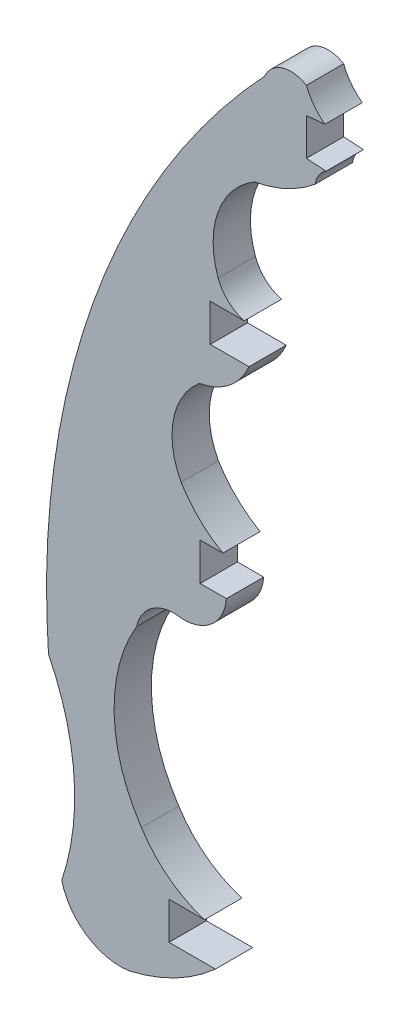
ISO-10303-21;
HEADER;
FILE_DESCRIPTION(('STEP AP214'),'2;1');
FILE_NAME('part.step','',(''),(''),'','','');
FILE_SCHEMA(('AUTOMOTIVE_DESIGN { 1 0 10303 214 1 1 1 1 }'));
ENDSEC;
DATA;
#1=APPLICATION_CONTEXT('core data for automotive mechanical design processes');
#2=APPLICATION_PROTOCOL_DEFINITION('international standard','automotive_design',2000,#1);
#3=PRODUCT_CONTEXT('',#1,'mechanical');
#4=PRODUCT('Part','Part','',(#3));
#5=PRODUCT_RELATED_PRODUCT_CATEGORY('part','',(#4));
#6=PRODUCT_DEFINITION_FORMATION('','',#4);
#7=PRODUCT_DEFINITION_CONTEXT('part definition',#1,'design');
#8=PRODUCT_DEFINITION('design','',#6,#7);
#9=PRODUCT_DEFINITION_SHAPE('','',#8);
#10=(LENGTH_UNIT() NAMED_UNIT(*) SI_UNIT(.MILLI.,.METRE.));
#11=(NAMED_UNIT(*) PLANE_ANGLE_UNIT() SI_UNIT($,.RADIAN.));
#12=(NAMED_UNIT(*) SI_UNIT($,.STERADIAN.) SOLID_ANGLE_UNIT());
#13=UNCERTAINTY_MEASURE_WITH_UNIT(LENGTH_MEASURE(1.E-05),#10,'distance_accuracy_value','');
#14=(GEOMETRIC_REPRESENTATION_CONTEXT(3) GLOBAL_UNCERTAINTY_ASSIGNED_CONTEXT((#13)) GLOBAL_UNIT_ASSIGNED_CONTEXT((#10,
#11,#12)) REPRESENTATION_CONTEXT('',''));
#15=CARTESIAN_POINT('',(0.,0.,0.));
#16=DIRECTION('',(0.,0.,1.));
#17=DIRECTION('',(1.,0.,0.));
#18=AXIS2_PLACEMENT_3D('',#15,#16,#17);
#19=CARTESIAN_POINT('',(-107.580688720072,16.4812326560787,1.524));
#20=DIRECTION('',(0.,0.,-1.));
#21=DIRECTION('',(-1.,0.,0.));
#22=AXIS2_PLACEMENT_3D('',#19,#20,#21);
#23=CYLINDRICAL_SURFACE('',#22,3.12128836578655);
#24=CARTESIAN_POINT('',(-107.580688720072,16.4812326560787,0.));
#25=DIRECTION('',(0.,0.,1.));
#26=DIRECTION('',(1.,0.,0.));
#27=AXIS2_PLACEMENT_3D('',#24,#25,#26);
#28=CIRCLE('',#27,3.12128836578655);
#29=CARTESIAN_POINT('',(-109.57918557092,18.878825490475,0.));
#30=VERTEX_POINT('',#29);
#31=CARTESIAN_POINT('',(-110.328866366672,15.0013810807081,0.));
#32=VERTEX_POINT('',#31);
#33=EDGE_CURVE('E253',#30,#32,#28,.T.);
#34=ORIENTED_EDGE('',*,*,#33,.F.);
#35=DIRECTION('',(0.,0.,-1.));
#36=VECTOR('',#35,1.);
#37=CARTESIAN_POINT('',(-109.57918557092,18.878825490475,1.524));
#38=LINE('',#37,#36);
#39=CARTESIAN_POINT('',(-109.57918557092,18.878825490475,1.524));
#40=VERTEX_POINT('',#39);
#41=EDGE_CURVE('E11',#40,#30,#38,.T.);
#42=ORIENTED_EDGE('',*,*,#41,.F.);
#43=CARTESIAN_POINT('',(-107.580688720072,16.4812326560787,1.524));
#44=DIRECTION('',(0.,0.,1.));
#45=DIRECTION('',(1.,0.,0.));
#46=AXIS2_PLACEMENT_3D('',#43,#44,#45);
#47=CIRCLE('',#46,3.12128836578655);
#48=CARTESIAN_POINT('',(-110.328866366672,15.0013810807081,1.524));
#49=VERTEX_POINT('',#48);
#50=EDGE_CURVE('E332',#40,#49,#47,.T.);
#51=ORIENTED_EDGE('',*,*,#50,.T.);
#52=DIRECTION('',(0.,0.,-1.));
#53=VECTOR('',#52,1.);
#54=CARTESIAN_POINT('',(-110.328866366672,15.0013810807081,1.524));
#55=LINE('',#54,#53);
#56=EDGE_CURVE('E146',#49,#32,#55,.T.);
#57=ORIENTED_EDGE('',*,*,#56,.T.);
#58=EDGE_LOOP('',(#34,#42,#51,#57));
#59=FACE_BOUND('',#58,.T.);
#60=ADVANCED_FACE('F33',(#59),#23,.F.);
#61=CARTESIAN_POINT('',(-110.027978736607,21.5229388257653,1.524));
#62=DIRECTION('',(0.,0.,-1.));
#63=DIRECTION('',(-1.,0.,0.));
#64=AXIS2_PLACEMENT_3D('',#61,#62,#63);
#65=CYLINDRICAL_SURFACE('',#64,2.68193039347167);
#66=CARTESIAN_POINT('',(-110.027978736607,21.5229388257653,0.));
#67=DIRECTION('',(0.,0.,1.));
#68=DIRECTION('',(1.,0.,0.));
#69=AXIS2_PLACEMENT_3D('',#66,#67,#68);
#70=CIRCLE('',#69,2.68193039347167);
#71=CARTESIAN_POINT('',(-107.557691457711,20.4787015945033,0.));
#72=VERTEX_POINT('',#71);
#73=EDGE_CURVE('E256',#72,#30,#70,.F.);
#74=ORIENTED_EDGE('',*,*,#73,.F.);
#75=DIRECTION('',(0.,0.,-1.));
#76=VECTOR('',#75,1.);
#77=CARTESIAN_POINT('',(-107.557691457711,20.4787015945033,1.524));
#78=LINE('',#77,#76);
#79=CARTESIAN_POINT('',(-107.557691457711,20.4787015945033,1.524));
#80=VERTEX_POINT('',#79);
#81=EDGE_CURVE('E41',#80,#72,#78,.T.);
#82=ORIENTED_EDGE('',*,*,#81,.F.);
#83=CARTESIAN_POINT('',(-110.027978736607,21.5229388257653,1.524));
#84=DIRECTION('',(0.,0.,1.));
#85=DIRECTION('',(1.,0.,0.));
#86=AXIS2_PLACEMENT_3D('',#83,#84,#85);
#87=CIRCLE('',#86,2.68193039347167);
#88=EDGE_CURVE('E406',#80,#40,#87,.F.);
#89=ORIENTED_EDGE('',*,*,#88,.T.);
#90=ORIENTED_EDGE('',*,*,#41,.T.);
#91=EDGE_LOOP('',(#74,#82,#89,#90));
#92=FACE_BOUND('',#91,.T.);
#93=ADVANCED_FACE('F394',(#92),#65,.T.);
#94=CARTESIAN_POINT('',(0.,20.4787015945033,1.524));
#95=DIRECTION('',(0.,1.,0.));
#96=DIRECTION('',(0.,0.,1.));
#97=AXIS2_PLACEMENT_3D('',#94,#95,#96);
#98=PLANE('',#97);
#99=DIRECTION('',(1.,0.,0.));
#100=VECTOR('',#99,1.);
#101=CARTESIAN_POINT('',(0.,20.4787015945033,0.));
#102=LINE('',#101,#100);
#103=CARTESIAN_POINT('',(-109.139263732456,20.4787015945033,0.));
#104=VERTEX_POINT('',#103);
#105=EDGE_CURVE('E259',#104,#72,#102,.T.);
#106=ORIENTED_EDGE('',*,*,#105,.F.);
#107=DIRECTION('',(0.,0.,-1.));
#108=VECTOR('',#107,1.);
#109=CARTESIAN_POINT('',(-109.139263732456,20.4787015945033,1.524));
#110=LINE('',#109,#108);
#111=CARTESIAN_POINT('',(-109.139263732456,20.4787015945033,1.524));
#112=VERTEX_POINT('',#111);
#113=EDGE_CURVE('E383',#112,#104,#110,.T.);
#114=ORIENTED_EDGE('',*,*,#113,.F.);
#115=DIRECTION('',(1.,0.,0.));
#116=VECTOR('',#115,1.);
#117=CARTESIAN_POINT('',(0.,20.4787015945033,1.524));
#118=LINE('',#117,#116);
#119=EDGE_CURVE('E390',#112,#80,#118,.T.);
#120=ORIENTED_EDGE('',*,*,#119,.T.);
#121=ORIENTED_EDGE('',*,*,#81,.T.);
#122=EDGE_LOOP('',(#106,#114,#120,#121));
#123=FACE_BOUND('',#122,.T.);
#124=ADVANCED_FACE('F388',(#123),#98,.T.);
#125=CARTESIAN_POINT('',(-109.139263732456,0.,1.524));
#126=DIRECTION('',(1.,0.,0.));
#127=DIRECTION('',(0.,0.,-1.));
#128=AXIS2_PLACEMENT_3D('',#125,#126,#127);
#129=PLANE('',#128);
#130=DIRECTION('',(0.,-1.,0.));
#131=VECTOR('',#130,1.);
#132=CARTESIAN_POINT('',(-109.139263732456,0.,0.));
#133=LINE('',#132,#131);
#134=CARTESIAN_POINT('',(-109.139263732456,22.0063903598248,0.));
#135=VERTEX_POINT('',#134);
#136=EDGE_CURVE('E262',#135,#104,#133,.T.);
#137=ORIENTED_EDGE('',*,*,#136,.F.);
#138=DIRECTION('',(0.,0.,-1.));
#139=VECTOR('',#138,1.);
#140=CARTESIAN_POINT('',(-109.139263732456,22.0063903598248,1.524));
#141=LINE('',#140,#139);
#142=CARTESIAN_POINT('',(-109.139263732456,22.0063903598248,1.524));
#143=VERTEX_POINT('',#142);
#144=EDGE_CURVE('E381',#143,#135,#141,.T.);
#145=ORIENTED_EDGE('',*,*,#144,.F.);
#146=DIRECTION('',(0.,-1.,0.));
#147=VECTOR('',#146,1.);
#148=CARTESIAN_POINT('',(-109.139263732456,0.,1.524));
#149=LINE('',#148,#147);
#150=EDGE_CURVE('E405',#143,#112,#149,.T.);
#151=ORIENTED_EDGE('',*,*,#150,.T.);
#152=ORIENTED_EDGE('',*,*,#113,.T.);
#153=EDGE_LOOP('',(#137,#145,#151,#152));
#154=FACE_BOUND('',#153,.T.);
#155=ADVANCED_FACE('F401',(#154),#129,.T.);
#156=CARTESIAN_POINT('',(0.,22.0063903598248,1.524));
#157=DIRECTION('',(0.,1.,0.));
#158=DIRECTION('',(0.,0.,1.));
#159=AXIS2_PLACEMENT_3D('',#156,#157,#158);
#160=PLANE('',#159);
#161=DIRECTION('',(1.,0.,0.));
#162=VECTOR('',#161,1.);
#163=CARTESIAN_POINT('',(0.,22.0063903598248,0.));
#164=LINE('',#163,#162);
#165=CARTESIAN_POINT('',(-107.752531071807,22.0063903598248,0.));
#166=VERTEX_POINT('',#165);
#167=EDGE_CURVE('E265',#135,#166,#164,.T.);
#168=ORIENTED_EDGE('',*,*,#167,.T.);
#169=DIRECTION('',(0.,0.,-1.));
#170=VECTOR('',#169,1.);
#171=CARTESIAN_POINT('',(-107.752531071807,22.0063903598248,1.524));
#172=LINE('',#171,#170);
#173=CARTESIAN_POINT('',(-107.752531071807,22.0063903598248,1.524));
#174=VERTEX_POINT('',#173);
#175=EDGE_CURVE('E378',#174,#166,#172,.T.);
#176=ORIENTED_EDGE('',*,*,#175,.F.);
#177=DIRECTION('',(1.,0.,0.));
#178=VECTOR('',#177,1.);
#179=CARTESIAN_POINT('',(0.,22.0063903598248,1.524));
#180=LINE('',#179,#178);
#181=EDGE_CURVE('E408',#143,#174,#180,.T.);
#182=ORIENTED_EDGE('',*,*,#181,.F.);
#183=ORIENTED_EDGE('',*,*,#144,.T.);
#184=EDGE_LOOP('',(#168,#176,#182,#183));
#185=FACE_BOUND('',#184,.T.);
#186=ADVANCED_FACE('F490',(#185),#160,.F.);
#187=CARTESIAN_POINT('',(-107.333912624667,23.5262694653189,1.524));
#188=DIRECTION('',(0.,0.,-1.));
#189=DIRECTION('',(-1.,0.,0.));
#190=AXIS2_PLACEMENT_3D('',#187,#188,#189);
#191=CYLINDRICAL_SURFACE('',#190,1.57647515032854);
#192=CARTESIAN_POINT('',(-107.333912624667,23.5262694653189,0.));
#193=DIRECTION('',(0.,0.,1.));
#194=DIRECTION('',(1.,0.,0.));
#195=AXIS2_PLACEMENT_3D('',#192,#193,#194);
#196=CIRCLE('',#195,1.57647515032854);
#197=CARTESIAN_POINT('',(-108.817338403116,22.9926761188112,0.));
#198=VERTEX_POINT('',#197);
#199=EDGE_CURVE('E267',#166,#198,#196,.F.);
#200=ORIENTED_EDGE('',*,*,#199,.T.);
#201=DIRECTION('',(0.,0.,-1.));
#202=VECTOR('',#201,1.);
#203=CARTESIAN_POINT('',(-108.817338403116,22.9926761188112,1.524));
#204=LINE('',#203,#202);
#205=CARTESIAN_POINT('',(-108.817338403116,22.9926761188112,1.524));
#206=VERTEX_POINT('',#205);
#207=EDGE_CURVE('E375',#206,#198,#204,.T.);
#208=ORIENTED_EDGE('',*,*,#207,.F.);
#209=CARTESIAN_POINT('',(-107.333912624667,23.5262694653189,1.524));
#210=DIRECTION('',(0.,0.,1.));
#211=DIRECTION('',(1.,0.,0.));
#212=AXIS2_PLACEMENT_3D('',#209,#210,#211);
#213=CIRCLE('',#212,1.57647515032854);
#214=EDGE_CURVE('E414',#174,#206,#213,.F.);
#215=ORIENTED_EDGE('',*,*,#214,.F.);
#216=ORIENTED_EDGE('',*,*,#175,.T.);
#217=EDGE_LOOP('',(#200,#208,#215,#216));
#218=FACE_BOUND('',#217,.T.);
#219=ADVANCED_FACE('F493',(#218),#191,.F.);
#220=CARTESIAN_POINT('',(-105.565537038083,24.1623602363142,1.524));
#221=DIRECTION('',(0.,0.,-1.));
#222=DIRECTION('',(-1.,0.,0.));
#223=AXIS2_PLACEMENT_3D('',#220,#221,#222);
#224=CYLINDRICAL_SURFACE('',#223,3.45577387170587);
#225=CARTESIAN_POINT('',(-105.565537038083,24.1623602363142,0.));
#226=DIRECTION('',(0.,0.,1.));
#227=DIRECTION('',(1.,0.,0.));
#228=AXIS2_PLACEMENT_3D('',#225,#226,#227);
#229=CIRCLE('',#228,3.45577387170587);
#230=CARTESIAN_POINT('',(-107.333979521729,27.1313641491447,0.));
#231=VERTEX_POINT('',#230);
#232=EDGE_CURVE('E269',#198,#231,#229,.F.);
#233=ORIENTED_EDGE('',*,*,#232,.T.);
#234=DIRECTION('',(0.,0.,-1.));
#235=VECTOR('',#234,1.);
#236=CARTESIAN_POINT('',(-107.333979521729,27.1313641491447,1.524));
#237=LINE('',#236,#235);
#238=CARTESIAN_POINT('',(-107.333979521729,27.1313641491447,1.524));
#239=VERTEX_POINT('',#238);
#240=EDGE_CURVE('E373',#239,#231,#237,.T.);
#241=ORIENTED_EDGE('',*,*,#240,.F.);
#242=CARTESIAN_POINT('',(-105.565537038083,24.1623602363142,1.524));
#243=DIRECTION('',(0.,0.,1.));
#244=DIRECTION('',(1.,0.,0.));
#245=AXIS2_PLACEMENT_3D('',#242,#243,#244);
#246=CIRCLE('',#245,3.45577387170587);
#247=EDGE_CURVE('E416',#206,#239,#246,.F.);
#248=ORIENTED_EDGE('',*,*,#247,.F.);
#249=ORIENTED_EDGE('',*,*,#207,.T.);
#250=EDGE_LOOP('',(#233,#241,#248,#249));
#251=FACE_BOUND('',#250,.T.);
#252=ADVANCED_FACE('F497',(#251),#224,.F.);
#253=CARTESIAN_POINT('',(-108.280674511607,32.3944754546542,1.524));
#254=DIRECTION('',(0.,0.,-1.));
#255=DIRECTION('',(-1.,0.,0.));
#256=AXIS2_PLACEMENT_3D('',#253,#254,#255);
#257=CYLINDRICAL_SURFACE('',#256,5.34757627510278);
#258=CARTESIAN_POINT('',(-108.280674511607,32.3944754546542,0.));
#259=DIRECTION('',(0.,0.,1.));
#260=DIRECTION('',(1.,0.,0.));
#261=AXIS2_PLACEMENT_3D('',#258,#259,#260);
#262=CIRCLE('',#261,5.34757627510278);
#263=CARTESIAN_POINT('',(-104.849681876034,28.2926634705814,0.));
#264=VERTEX_POINT('',#263);
#265=EDGE_CURVE('E272',#264,#231,#262,.F.);
#266=ORIENTED_EDGE('',*,*,#265,.F.);
#267=DIRECTION('',(0.,0.,-1.));
#268=VECTOR('',#267,1.);
#269=CARTESIAN_POINT('',(-104.849681876034,28.2926634705814,1.524));
#270=LINE('',#269,#268);
#271=CARTESIAN_POINT('',(-104.849681876034,28.2926634705814,1.524));
#272=VERTEX_POINT('',#271);
#273=EDGE_CURVE('E371',#272,#264,#270,.T.);
#274=ORIENTED_EDGE('',*,*,#273,.F.);
#275=CARTESIAN_POINT('',(-108.280674511607,32.3944754546542,1.524));
#276=DIRECTION('',(0.,0.,1.));
#277=DIRECTION('',(1.,0.,0.));
#278=AXIS2_PLACEMENT_3D('',#275,#276,#277);
#279=CIRCLE('',#278,5.34757627510278);
#280=EDGE_CURVE('E418',#272,#239,#279,.F.);
#281=ORIENTED_EDGE('',*,*,#280,.T.);
#282=ORIENTED_EDGE('',*,*,#240,.T.);
#283=EDGE_LOOP('',(#266,#274,#281,#282));
#284=FACE_BOUND('',#283,.T.);
#285=ADVANCED_FACE('F501',(#284),#257,.T.);
#286=CARTESIAN_POINT('',(-103.869108877583,28.1418799717256,1.524));
#287=DIRECTION('',(0.,0.,-1.));
#288=DIRECTION('',(-1.,0.,0.));
#289=AXIS2_PLACEMENT_3D('',#286,#287,#288);
#290=CYLINDRICAL_SURFACE('',#289,0.992098316104333);
#291=CARTESIAN_POINT('',(-103.869108877583,28.1418799717256,0.));
#292=DIRECTION('',(0.,0.,1.));
#293=DIRECTION('',(1.,0.,0.));
#294=AXIS2_PLACEMENT_3D('',#291,#292,#293);
#295=CIRCLE('',#294,0.992098316104333);
#296=CARTESIAN_POINT('',(-104.403994807569,28.9774373370335,0.));
#297=VERTEX_POINT('',#296);
#298=EDGE_CURVE('E275',#297,#264,#295,.T.);
#299=ORIENTED_EDGE('',*,*,#298,.F.);
#300=DIRECTION('',(0.,0.,-1.));
#301=VECTOR('',#300,1.);
#302=CARTESIAN_POINT('',(-104.403994807569,28.9774373370335,1.524));
#303=LINE('',#302,#301);
#304=CARTESIAN_POINT('',(-104.403994807569,28.9774373370335,1.524));
#305=VERTEX_POINT('',#304);
#306=EDGE_CURVE('E369',#305,#297,#303,.T.);
#307=ORIENTED_EDGE('',*,*,#306,.F.);
#308=CARTESIAN_POINT('',(-103.869108877583,28.1418799717256,1.524));
#309=DIRECTION('',(0.,0.,1.));
#310=DIRECTION('',(1.,0.,0.));
#311=AXIS2_PLACEMENT_3D('',#308,#309,#310);
#312=CIRCLE('',#311,0.992098316104333);
#313=EDGE_CURVE('E421',#305,#272,#312,.T.);
#314=ORIENTED_EDGE('',*,*,#313,.T.);
#315=ORIENTED_EDGE('',*,*,#273,.T.);
#316=EDGE_LOOP('',(#299,#307,#314,#315));
#317=FACE_BOUND('',#316,.T.);
#318=ADVANCED_FACE('F505',(#317),#290,.F.);
#319=CARTESIAN_POINT('',(1.34778701210068,22.6979872481388,1.524));
#320=DIRECTION('',(0.0592747362554911,0.998241707023826,0.));
#321=DIRECTION('',(-0.998241707023826,0.0592747362554911,0.));
#322=AXIS2_PLACEMENT_3D('',#319,#320,#321);
#323=PLANE('',#322);
#324=DIRECTION('',(0.998241707023826,-0.0592747362554911,0.));
#325=VECTOR('',#324,1.);
#326=CARTESIAN_POINT('',(1.34778701210068,22.6979872481388,0.));
#327=LINE('',#326,#325);
#328=CARTESIAN_POINT('',(-105.211200263327,29.0253685045627,0.));
#329=VERTEX_POINT('',#328);
#330=EDGE_CURVE('E278',#329,#297,#327,.T.);
#331=ORIENTED_EDGE('',*,*,#330,.F.);
#332=DIRECTION('',(0.,0.,-1.));
#333=VECTOR('',#332,1.);
#334=CARTESIAN_POINT('',(-105.211200263327,29.0253685045627,1.524));
#335=LINE('',#334,#333);
#336=CARTESIAN_POINT('',(-105.211200263327,29.0253685045627,1.524));
#337=VERTEX_POINT('',#336);
#338=EDGE_CURVE('E367',#337,#329,#335,.T.);
#339=ORIENTED_EDGE('',*,*,#338,.F.);
#340=DIRECTION('',(0.998241707023826,-0.0592747362554911,0.));
#341=VECTOR('',#340,1.);
#342=CARTESIAN_POINT('',(1.34778701210068,22.6979872481388,1.524));
#343=LINE('',#342,#341);
#344=EDGE_CURVE('E424',#337,#305,#343,.T.);
#345=ORIENTED_EDGE('',*,*,#344,.T.);
#346=ORIENTED_EDGE('',*,*,#306,.T.);
#347=EDGE_LOOP('',(#331,#339,#345,#346));
#348=FACE_BOUND('',#347,.T.);
#349=ADVANCED_FACE('F509',(#348),#323,.T.);
#350=CARTESIAN_POINT('',(-105.211200263327,0.,1.524));
#351=DIRECTION('',(1.,0.,0.));
#352=DIRECTION('',(0.,0.,-1.));
#353=AXIS2_PLACEMENT_3D('',#350,#351,#352);
#354=PLANE('',#353);
#355=DIRECTION('',(0.,-1.,0.));
#356=VECTOR('',#355,1.);
#357=CARTESIAN_POINT('',(-105.211200263327,0.,0.));
#358=LINE('',#357,#356);
#359=CARTESIAN_POINT('',(-105.211200263327,30.5448254073895,0.));
#360=VERTEX_POINT('',#359);
#361=EDGE_CURVE('E281',#360,#329,#358,.T.);
#362=ORIENTED_EDGE('',*,*,#361,.F.);
#363=DIRECTION('',(0.,0.,-1.));
#364=VECTOR('',#363,1.);
#365=CARTESIAN_POINT('',(-105.211200263327,30.5448254073895,1.524));
#366=LINE('',#365,#364);
#367=CARTESIAN_POINT('',(-105.211200263327,30.5448254073895,1.524));
#368=VERTEX_POINT('',#367);
#369=EDGE_CURVE('E365',#368,#360,#366,.T.);
#370=ORIENTED_EDGE('',*,*,#369,.F.);
#371=DIRECTION('',(0.,-1.,0.));
#372=VECTOR('',#371,1.);
#373=CARTESIAN_POINT('',(-105.211200263327,0.,1.524));
#374=LINE('',#373,#372);
#375=EDGE_CURVE('E427',#368,#337,#374,.T.);
#376=ORIENTED_EDGE('',*,*,#375,.T.);
#377=ORIENTED_EDGE('',*,*,#338,.T.);
#378=EDGE_LOOP('',(#362,#370,#376,#377));
#379=FACE_BOUND('',#378,.T.);
#380=ADVANCED_FACE('F513',(#379),#354,.T.);
#381=CARTESIAN_POINT('',(-3.48086621479973,39.5078469395772,1.524));
#382=DIRECTION('',(0.0877657054415344,-0.99614114509358,0.));
#383=DIRECTION('',(0.996141145093581,0.0877657054415344,0.));
#384=AXIS2_PLACEMENT_3D('',#381,#382,#383);
#385=PLANE('',#384);
#386=DIRECTION('',(-0.996141145093581,-0.0877657054415344,0.));
#387=VECTOR('',#386,1.);
#388=CARTESIAN_POINT('',(-3.48086621479973,39.5078469395772,0.));
#389=LINE('',#388,#387);
#390=CARTESIAN_POINT('',(-104.454303839496,30.611512290981,0.));
#391=VERTEX_POINT('',#390);
#392=EDGE_CURVE('E284',#391,#360,#389,.T.);
#393=ORIENTED_EDGE('',*,*,#392,.F.);
#394=DIRECTION('',(0.,0.,-1.));
#395=VECTOR('',#394,1.);
#396=CARTESIAN_POINT('',(-104.454303839496,30.611512290981,1.524));
#397=LINE('',#396,#395);
#398=CARTESIAN_POINT('',(-104.454303839496,30.611512290981,1.524));
#399=VERTEX_POINT('',#398);
#400=EDGE_CURVE('E363',#399,#391,#397,.T.);
#401=ORIENTED_EDGE('',*,*,#400,.F.);
#402=DIRECTION('',(-0.996141145093581,-0.0877657054415344,0.));
#403=VECTOR('',#402,1.);
#404=CARTESIAN_POINT('',(-3.48086621479973,39.5078469395772,1.524));
#405=LINE('',#404,#403);
#406=EDGE_CURVE('E430',#399,#368,#405,.T.);
#407=ORIENTED_EDGE('',*,*,#406,.T.);
#408=ORIENTED_EDGE('',*,*,#369,.T.);
#409=EDGE_LOOP('',(#393,#401,#407,#408));
#410=FACE_BOUND('',#409,.T.);
#411=ADVANCED_FACE('F517',(#410),#385,.T.);
#412=CARTESIAN_POINT('',(-103.059366981798,32.4561400903915,1.524));
#413=DIRECTION('',(0.,0.,-1.));
#414=DIRECTION('',(-1.,0.,0.));
#415=AXIS2_PLACEMENT_3D('',#412,#413,#414);
#416=CYLINDRICAL_SURFACE('',#415,2.31268254529747);
#417=CARTESIAN_POINT('',(-103.059366981798,32.4561400903915,0.));
#418=DIRECTION('',(0.,0.,1.));
#419=DIRECTION('',(1.,0.,0.));
#420=AXIS2_PLACEMENT_3D('',#417,#418,#419);
#421=CIRCLE('',#420,2.31268254529747);
#422=CARTESIAN_POINT('',(-105.211200263327,31.6087239683895,0.));
#423=VERTEX_POINT('',#422);
#424=EDGE_CURVE('E287',#423,#391,#421,.T.);
#425=ORIENTED_EDGE('',*,*,#424,.F.);
#426=DIRECTION('',(0.,0.,-1.));
#427=VECTOR('',#426,1.);
#428=CARTESIAN_POINT('',(-105.211200263327,31.6087239683895,1.524));
#429=LINE('',#428,#427);
#430=CARTESIAN_POINT('',(-105.211200263327,31.6087239683895,1.524));
#431=VERTEX_POINT('',#430);
#432=EDGE_CURVE('E361',#431,#423,#429,.T.);
#433=ORIENTED_EDGE('',*,*,#432,.F.);
#434=CARTESIAN_POINT('',(-103.059366981798,32.4561400903915,1.524));
#435=DIRECTION('',(0.,0.,1.));
#436=DIRECTION('',(1.,0.,0.));
#437=AXIS2_PLACEMENT_3D('',#434,#435,#436);
#438=CIRCLE('',#437,2.31268254529747);
#439=EDGE_CURVE('E433',#431,#399,#438,.T.);
#440=ORIENTED_EDGE('',*,*,#439,.T.);
#441=ORIENTED_EDGE('',*,*,#400,.T.);
#442=EDGE_LOOP('',(#425,#433,#440,#441));
#443=FACE_BOUND('',#442,.T.);
#444=ADVANCED_FACE('F521',(#443),#416,.F.);
#445=CARTESIAN_POINT('',(-105.837320906782,30.611512290981,1.524));
#446=DIRECTION('',(0.,0.,-1.));
#447=DIRECTION('',(-1.,0.,0.));
#448=AXIS2_PLACEMENT_3D('',#445,#446,#447);
#449=CYLINDRICAL_SURFACE('',#448,1.17747959206144);
#450=CARTESIAN_POINT('',(-105.837320906782,30.611512290981,0.));
#451=DIRECTION('',(0.,0.,1.));
#452=DIRECTION('',(1.,0.,0.));
#453=AXIS2_PLACEMENT_3D('',#450,#451,#452);
#454=CIRCLE('',#453,1.17747959206144);
#455=CARTESIAN_POINT('',(-106.916865485232,31.0816630039028,0.));
#456=VERTEX_POINT('',#455);
#457=EDGE_CURVE('E290',#456,#423,#454,.F.);
#458=ORIENTED_EDGE('',*,*,#457,.F.);
#459=DIRECTION('',(0.,0.,-1.));
#460=VECTOR('',#459,1.);
#461=CARTESIAN_POINT('',(-106.916865485232,31.0816630039028,1.524));
#462=LINE('',#461,#460);
#463=CARTESIAN_POINT('',(-106.916865485232,31.0816630039028,1.524));
#464=VERTEX_POINT('',#463);
#465=EDGE_CURVE('E359',#464,#456,#462,.T.);
#466=ORIENTED_EDGE('',*,*,#465,.F.);
#467=CARTESIAN_POINT('',(-105.837320906782,30.611512290981,1.524));
#468=DIRECTION('',(0.,0.,1.));
#469=DIRECTION('',(1.,0.,0.));
#470=AXIS2_PLACEMENT_3D('',#467,#468,#469);
#471=CIRCLE('',#470,1.17747959206144);
#472=EDGE_CURVE('E436',#464,#431,#471,.F.);
#473=ORIENTED_EDGE('',*,*,#472,.T.);
#474=ORIENTED_EDGE('',*,*,#432,.T.);
#475=EDGE_LOOP('',(#458,#466,#473,#474));
#476=FACE_BOUND('',#475,.T.);
#477=ADVANCED_FACE('F525',(#476),#449,.T.);
#478=CARTESIAN_POINT('',(-82.7656833760453,8.50088602335713,1.524));
#479=DIRECTION('',(0.,0.,-1.));
#480=DIRECTION('',(-1.,0.,0.));
#481=AXIS2_PLACEMENT_3D('',#478,#479,#480);
#482=CYLINDRICAL_SURFACE('',#481,33.0631378776461);
#483=CARTESIAN_POINT('',(-82.7656833760453,8.50088602335713,0.));
#484=DIRECTION('',(0.,0.,1.));
#485=DIRECTION('',(1.,0.,0.));
#486=AXIS2_PLACEMENT_3D('',#483,#484,#485);
#487=CIRCLE('',#486,33.0631378776461);
#488=CARTESIAN_POINT('',(-115.749307819385,6.20924798541367,0.));
#489=VERTEX_POINT('',#488);
#490=EDGE_CURVE('E293',#489,#456,#487,.F.);
#491=ORIENTED_EDGE('',*,*,#490,.F.);
#492=DIRECTION('',(0.,0.,-1.));
#493=VECTOR('',#492,1.);
#494=CARTESIAN_POINT('',(-115.749307819385,6.20924798541367,1.524));
#495=LINE('',#494,#493);
#496=CARTESIAN_POINT('',(-115.749307819385,6.20924798541367,1.524));
#497=VERTEX_POINT('',#496);
#498=EDGE_CURVE('E357',#497,#489,#495,.T.);
#499=ORIENTED_EDGE('',*,*,#498,.F.);
#500=CARTESIAN_POINT('',(-82.7656833760453,8.50088602335713,1.524));
#501=DIRECTION('',(0.,0.,1.));
#502=DIRECTION('',(1.,0.,0.));
#503=AXIS2_PLACEMENT_3D('',#500,#501,#502);
#504=CIRCLE('',#503,33.0631378776461);
#505=EDGE_CURVE('E439',#497,#464,#504,.F.);
#506=ORIENTED_EDGE('',*,*,#505,.T.);
#507=ORIENTED_EDGE('',*,*,#465,.T.);
#508=EDGE_LOOP('',(#491,#499,#506,#507));
#509=FACE_BOUND('',#508,.T.);
#510=ADVANCED_FACE('F529',(#509),#482,.T.);
#511=CARTESIAN_POINT('',(-124.730508792739,1.69476314171867,1.524));
#512=DIRECTION('',(0.,0.,-1.));
#513=DIRECTION('',(-1.,0.,0.));
#514=AXIS2_PLACEMENT_3D('',#511,#512,#513);
#515=CYLINDRICAL_SURFACE('',#514,10.0519920576827);
#516=CARTESIAN_POINT('',(-124.730508792739,1.69476314171867,0.));
#517=DIRECTION('',(0.,0.,1.));
#518=DIRECTION('',(1.,0.,0.));
#519=AXIS2_PLACEMENT_3D('',#516,#517,#518);
#520=CIRCLE('',#519,10.0519920576827);
#521=CARTESIAN_POINT('',(-115.20779341501,-1.524,0.));
#522=VERTEX_POINT('',#521);
#523=EDGE_CURVE('E296',#522,#489,#520,.T.);
#524=ORIENTED_EDGE('',*,*,#523,.F.);
#525=DIRECTION('',(0.,0.,-1.));
#526=VECTOR('',#525,1.);
#527=CARTESIAN_POINT('',(-115.20779341501,-1.524,1.524));
#528=LINE('',#527,#526);
#529=CARTESIAN_POINT('',(-115.20779341501,-1.524,1.524));
#530=VERTEX_POINT('',#529);
#531=EDGE_CURVE('E355',#530,#522,#528,.T.);
#532=ORIENTED_EDGE('',*,*,#531,.F.);
#533=CARTESIAN_POINT('',(-124.730508792739,1.69476314171867,1.524));
#534=DIRECTION('',(0.,0.,1.));
#535=DIRECTION('',(1.,0.,0.));
#536=AXIS2_PLACEMENT_3D('',#533,#534,#535);
#537=CIRCLE('',#536,10.0519920576827);
#538=EDGE_CURVE('E442',#530,#497,#537,.T.);
#539=ORIENTED_EDGE('',*,*,#538,.T.);
#540=ORIENTED_EDGE('',*,*,#498,.T.);
#541=EDGE_LOOP('',(#524,#532,#539,#540));
#542=FACE_BOUND('',#541,.T.);
#543=ADVANCED_FACE('F533',(#542),#515,.F.);
#544=CARTESIAN_POINT('',(-112.821376912459,-0.911900097014079,1.524));
#545=DIRECTION('',(0.,0.,-1.));
#546=DIRECTION('',(-1.,0.,0.));
#547=AXIS2_PLACEMENT_3D('',#544,#545,#546);
#548=CYLINDRICAL_SURFACE('',#547,2.46366597063845);
#549=CARTESIAN_POINT('',(-112.821376912459,-0.911900097014079,0.));
#550=DIRECTION('',(0.,0.,1.));
#551=DIRECTION('',(1.,0.,0.));
#552=AXIS2_PLACEMENT_3D('',#549,#550,#551);
#553=CIRCLE('',#552,2.46366597063845);
#554=CARTESIAN_POINT('',(-112.442883949143,-3.34631852686584,0.));
#555=VERTEX_POINT('',#554);
#556=EDGE_CURVE('E299',#555,#522,#553,.F.);
#557=ORIENTED_EDGE('',*,*,#556,.F.);
#558=DIRECTION('',(0.,0.,-1.));
#559=VECTOR('',#558,1.);
#560=CARTESIAN_POINT('',(-112.442883949143,-3.34631852686584,1.524));
#561=LINE('',#560,#559);
#562=CARTESIAN_POINT('',(-112.442883949143,-3.34631852686584,1.524));
#563=VERTEX_POINT('',#562);
#564=EDGE_CURVE('E353',#563,#555,#561,.T.);
#565=ORIENTED_EDGE('',*,*,#564,.F.);
#566=CARTESIAN_POINT('',(-112.821376912459,-0.911900097014079,1.524));
#567=DIRECTION('',(0.,0.,1.));
#568=DIRECTION('',(1.,0.,0.));
#569=AXIS2_PLACEMENT_3D('',#566,#567,#568);
#570=CIRCLE('',#569,2.46366597063845);
#571=EDGE_CURVE('E445',#563,#530,#570,.F.);
#572=ORIENTED_EDGE('',*,*,#571,.T.);
#573=ORIENTED_EDGE('',*,*,#531,.T.);
#574=EDGE_LOOP('',(#557,#565,#572,#573));
#575=FACE_BOUND('',#574,.T.);
#576=ADVANCED_FACE('F537',(#575),#548,.T.);
#577=CARTESIAN_POINT('',(-114.18936905214,4.32394775964582,1.524));
#578=DIRECTION('',(0.,0.,-1.));
#579=DIRECTION('',(-1.,0.,0.));
#580=AXIS2_PLACEMENT_3D('',#577,#578,#579);
#581=CYLINDRICAL_SURFACE('',#580,7.86658726011411);
#582=CARTESIAN_POINT('',(-114.18936905214,4.32394775964582,0.));
#583=DIRECTION('',(0.,0.,1.));
#584=DIRECTION('',(1.,0.,0.));
#585=AXIS2_PLACEMENT_3D('',#582,#583,#584);
#586=CIRCLE('',#585,7.86658726011411);
#587=CARTESIAN_POINT('',(-108.927743626339,-1.524,0.));
#588=VERTEX_POINT('',#587);
#589=EDGE_CURVE('E302',#588,#555,#586,.F.);
#590=ORIENTED_EDGE('',*,*,#589,.F.);
#591=DIRECTION('',(0.,0.,-1.));
#592=VECTOR('',#591,1.);
#593=CARTESIAN_POINT('',(-108.927743626339,-1.524,1.524));
#594=LINE('',#593,#592);
#595=CARTESIAN_POINT('',(-108.927743626339,-1.524,1.524));
#596=VERTEX_POINT('',#595);
#597=EDGE_CURVE('E351',#596,#588,#594,.T.);
#598=ORIENTED_EDGE('',*,*,#597,.F.);
#599=CARTESIAN_POINT('',(-114.18936905214,4.32394775964582,1.524));
#600=DIRECTION('',(0.,0.,1.));
#601=DIRECTION('',(1.,0.,0.));
#602=AXIS2_PLACEMENT_3D('',#599,#600,#601);
#603=CIRCLE('',#602,7.86658726011411);
#604=EDGE_CURVE('E448',#596,#563,#603,.F.);
#605=ORIENTED_EDGE('',*,*,#604,.T.);
#606=ORIENTED_EDGE('',*,*,#564,.T.);
#607=EDGE_LOOP('',(#590,#598,#605,#606));
#608=FACE_BOUND('',#607,.T.);
#609=ADVANCED_FACE('F541',(#608),#581,.T.);
#610=CARTESIAN_POINT('',(0.,-1.524,1.524));
#611=DIRECTION('',(0.,1.,0.));
#612=DIRECTION('',(0.,0.,1.));
#613=AXIS2_PLACEMENT_3D('',#610,#611,#612);
#614=PLANE('',#613);
#615=DIRECTION('',(1.,0.,0.));
#616=VECTOR('',#615,1.);
#617=CARTESIAN_POINT('',(0.,-1.524,0.));
#618=LINE('',#617,#616);
#619=CARTESIAN_POINT('',(-110.824360774291,-1.524,0.));
#620=VERTEX_POINT('',#619);
#621=EDGE_CURVE('E305',#620,#588,#618,.T.);
#622=ORIENTED_EDGE('',*,*,#621,.F.);
#623=DIRECTION('',(0.,0.,-1.));
#624=VECTOR('',#623,1.);
#625=CARTESIAN_POINT('',(-110.824360774291,-1.524,1.524));
#626=LINE('',#625,#624);
#627=CARTESIAN_POINT('',(-110.824360774291,-1.524,1.524));
#628=VERTEX_POINT('',#627);
#629=EDGE_CURVE('E349',#628,#620,#626,.T.);
#630=ORIENTED_EDGE('',*,*,#629,.F.);
#631=DIRECTION('',(1.,0.,0.));
#632=VECTOR('',#631,1.);
#633=CARTESIAN_POINT('',(0.,-1.524,1.524));
#634=LINE('',#633,#632);
#635=EDGE_CURVE('E451',#628,#596,#634,.T.);
#636=ORIENTED_EDGE('',*,*,#635,.T.);
#637=ORIENTED_EDGE('',*,*,#597,.T.);
#638=EDGE_LOOP('',(#622,#630,#636,#637));
#639=FACE_BOUND('',#638,.T.);
#640=ADVANCED_FACE('F545',(#639),#614,.T.);
#641=CARTESIAN_POINT('',(-110.824360774291,0.,1.524));
#642=DIRECTION('',(1.,0.,0.));
#643=DIRECTION('',(0.,0.,-1.));
#644=AXIS2_PLACEMENT_3D('',#641,#642,#643);
#645=PLANE('',#644);
#646=DIRECTION('',(0.,-1.,0.));
#647=VECTOR('',#646,1.);
#648=CARTESIAN_POINT('',(-110.824360774291,0.,0.));
#649=LINE('',#648,#647);
#650=CARTESIAN_POINT('',(-110.824360774291,0.,0.));
#651=VERTEX_POINT('',#650);
#652=EDGE_CURVE('E308',#651,#620,#649,.T.);
#653=ORIENTED_EDGE('',*,*,#652,.F.);
#654=DIRECTION('',(0.,0.,-1.));
#655=VECTOR('',#654,1.);
#656=CARTESIAN_POINT('',(-110.824360774291,0.,1.524));
#657=LINE('',#656,#655);
#658=CARTESIAN_POINT('',(-110.824360774291,0.,1.524));
#659=VERTEX_POINT('',#658);
#660=EDGE_CURVE('E347',#659,#651,#657,.T.);
#661=ORIENTED_EDGE('',*,*,#660,.F.);
#662=DIRECTION('',(0.,-1.,0.));
#663=VECTOR('',#662,1.);
#664=CARTESIAN_POINT('',(-110.824360774291,0.,1.524));
#665=LINE('',#664,#663);
#666=EDGE_CURVE('E454',#659,#628,#665,.T.);
#667=ORIENTED_EDGE('',*,*,#666,.T.);
#668=ORIENTED_EDGE('',*,*,#629,.T.);
#669=EDGE_LOOP('',(#653,#661,#667,#668));
#670=FACE_BOUND('',#669,.T.);
#671=ADVANCED_FACE('F549',(#670),#645,.T.);
#672=CARTESIAN_POINT('',(0.,-1.1494748147781E-13,1.524));
#673=DIRECTION('',(0.,1.,0.));
#674=DIRECTION('',(-1.,0.,0.));
#675=AXIS2_PLACEMENT_3D('',#672,#673,#674);
#676=PLANE('',#675);
#677=DIRECTION('',(1.,0.,0.));
#678=VECTOR('',#677,1.);
#679=CARTESIAN_POINT('',(0.,-1.1494748147781E-13,0.));
#680=LINE('',#679,#678);
#681=CARTESIAN_POINT('',(-109.373389254102,0.,0.));
#682=VERTEX_POINT('',#681);
#683=EDGE_CURVE('E311',#651,#682,#680,.T.);
#684=ORIENTED_EDGE('',*,*,#683,.T.);
#685=DIRECTION('',(0.,0.,-1.));
#686=VECTOR('',#685,1.);
#687=CARTESIAN_POINT('',(-109.373389254102,0.,1.524));
#688=LINE('',#687,#686);
#689=CARTESIAN_POINT('',(-109.373389254102,0.,1.524));
#690=VERTEX_POINT('',#689);
#691=EDGE_CURVE('E344',#690,#682,#688,.T.);
#692=ORIENTED_EDGE('',*,*,#691,.F.);
#693=DIRECTION('',(1.,0.,0.));
#694=VECTOR('',#693,1.);
#695=CARTESIAN_POINT('',(0.,-1.1494748147781E-13,1.524));
#696=LINE('',#695,#694);
#697=EDGE_CURVE('E457',#659,#690,#696,.T.);
#698=ORIENTED_EDGE('',*,*,#697,.F.);
#699=ORIENTED_EDGE('',*,*,#660,.T.);
#700=EDGE_LOOP('',(#684,#692,#698,#699));
#701=FACE_BOUND('',#700,.T.);
#702=ADVANCED_FACE('F553',(#701),#676,.F.);
#703=CARTESIAN_POINT('',(-107.97967598118,4.48553225992145,1.524));
#704=DIRECTION('',(0.,0.,-1.));
#705=DIRECTION('',(-1.,0.,0.));
#706=AXIS2_PLACEMENT_3D('',#703,#704,#705);
#707=CYLINDRICAL_SURFACE('',#706,4.69706678065338);
#708=CARTESIAN_POINT('',(-107.97967598118,4.48553225992145,0.));
#709=DIRECTION('',(0.,0.,1.));
#710=DIRECTION('',(1.,0.,0.));
#711=AXIS2_PLACEMENT_3D('',#708,#709,#710);
#712=CIRCLE('',#711,4.69706678065338);
#713=CARTESIAN_POINT('',(-111.950245847538,1.97614761856357,0.));
#714=VERTEX_POINT('',#713);
#715=EDGE_CURVE('E313',#682,#714,#712,.F.);
#716=ORIENTED_EDGE('',*,*,#715,.T.);
#717=DIRECTION('',(0.,0.,-1.));
#718=VECTOR('',#717,1.);
#719=CARTESIAN_POINT('',(-111.950245847538,1.97614761856357,1.524));
#720=LINE('',#719,#718);
#721=CARTESIAN_POINT('',(-111.950245847538,1.97614761856357,1.524));
#722=VERTEX_POINT('',#721);
#723=EDGE_CURVE('E342',#722,#714,#720,.T.);
#724=ORIENTED_EDGE('',*,*,#723,.F.);
#725=CARTESIAN_POINT('',(-107.97967598118,4.48553225992145,1.524));
#726=DIRECTION('',(0.,0.,1.));
#727=DIRECTION('',(1.,0.,0.));
#728=AXIS2_PLACEMENT_3D('',#725,#726,#727);
#729=CIRCLE('',#728,4.69706678065338);
#730=EDGE_CURVE('E459',#690,#722,#729,.F.);
#731=ORIENTED_EDGE('',*,*,#730,.F.);
#732=ORIENTED_EDGE('',*,*,#691,.T.);
#733=EDGE_LOOP('',(#716,#724,#731,#732));
#734=FACE_BOUND('',#733,.T.);
#735=ADVANCED_FACE('F557',(#734),#707,.F.);
#736=CARTESIAN_POINT('',(-106.520013862702,5.63759579505181,1.524));
#737=DIRECTION('',(0.,0.,-1.));
#738=DIRECTION('',(-1.,0.,0.));
#739=AXIS2_PLACEMENT_3D('',#736,#737,#738);
#740=CYLINDRICAL_SURFACE('',#739,6.54932226709318);
#741=CARTESIAN_POINT('',(-106.520013862702,5.63759579505181,0.));
#742=DIRECTION('',(0.,0.,1.));
#743=DIRECTION('',(1.,0.,0.));
#744=AXIS2_PLACEMENT_3D('',#741,#742,#743);
#745=CIRCLE('',#744,6.54932226709318);
#746=CARTESIAN_POINT('',(-112.143869500187,8.99406267660652,0.));
#747=VERTEX_POINT('',#746);
#748=EDGE_CURVE('E316',#747,#714,#745,.T.);
#749=ORIENTED_EDGE('',*,*,#748,.F.);
#750=DIRECTION('',(0.,0.,-1.));
#751=VECTOR('',#750,1.);
#752=CARTESIAN_POINT('',(-112.143869500187,8.99406267660652,1.524));
#753=LINE('',#752,#751);
#754=CARTESIAN_POINT('',(-112.143869500187,8.99406267660652,1.524));
#755=VERTEX_POINT('',#754);
#756=EDGE_CURVE('E340',#755,#747,#753,.T.);
#757=ORIENTED_EDGE('',*,*,#756,.F.);
#758=CARTESIAN_POINT('',(-106.520013862702,5.63759579505181,1.524));
#759=DIRECTION('',(0.,0.,1.));
#760=DIRECTION('',(1.,0.,0.));
#761=AXIS2_PLACEMENT_3D('',#758,#759,#760);
#762=CIRCLE('',#761,6.54932226709318);
#763=EDGE_CURVE('E461',#755,#722,#762,.T.);
#764=ORIENTED_EDGE('',*,*,#763,.T.);
#765=ORIENTED_EDGE('',*,*,#723,.T.);
#766=EDGE_LOOP('',(#749,#757,#764,#765));
#767=FACE_BOUND('',#766,.T.);
#768=ADVANCED_FACE('F561',(#767),#740,.F.);
#769=CARTESIAN_POINT('',(-110.632863237933,8.68429736091204,1.524));
#770=DIRECTION('',(0.,0.,-1.));
#771=DIRECTION('',(-1.,0.,0.));
#772=AXIS2_PLACEMENT_3D('',#769,#770,#771);
#773=CYLINDRICAL_SURFACE('',#772,1.54243135191798);
#774=CARTESIAN_POINT('',(-110.632863237933,8.68429736091204,0.));
#775=DIRECTION('',(0.,0.,1.));
#776=DIRECTION('',(1.,0.,0.));
#777=AXIS2_PLACEMENT_3D('',#774,#775,#776);
#778=CIRCLE('',#777,1.54243135191798);
#779=CARTESIAN_POINT('',(-110.328866366672,10.1964747240686,0.));
#780=VERTEX_POINT('',#779);
#781=EDGE_CURVE('E319',#780,#747,#778,.T.);
#782=ORIENTED_EDGE('',*,*,#781,.F.);
#783=DIRECTION('',(0.,0.,-1.));
#784=VECTOR('',#783,1.);
#785=CARTESIAN_POINT('',(-110.328866366672,10.1964747240686,1.524));
#786=LINE('',#785,#784);
#787=CARTESIAN_POINT('',(-110.328866366672,10.1964747240686,1.524));
#788=VERTEX_POINT('',#787);
#789=EDGE_CURVE('E338',#788,#780,#786,.T.);
#790=ORIENTED_EDGE('',*,*,#789,.F.);
#791=CARTESIAN_POINT('',(-110.632863237933,8.68429736091204,1.524));
#792=DIRECTION('',(0.,0.,1.));
#793=DIRECTION('',(1.,0.,0.));
#794=AXIS2_PLACEMENT_3D('',#791,#792,#793);
#795=CIRCLE('',#794,1.54243135191798);
#796=EDGE_CURVE('E464',#788,#755,#795,.T.);
#797=ORIENTED_EDGE('',*,*,#796,.T.);
#798=ORIENTED_EDGE('',*,*,#756,.T.);
#799=EDGE_LOOP('',(#782,#790,#797,#798));
#800=FACE_BOUND('',#799,.T.);
#801=ADVANCED_FACE('F565',(#800),#773,.F.);
#802=CARTESIAN_POINT('',(-110.220038630349,11.9391151050452,1.524));
#803=DIRECTION('',(0.,0.,-1.));
#804=DIRECTION('',(-1.,0.,0.));
#805=AXIS2_PLACEMENT_3D('',#802,#803,#804);
#806=CYLINDRICAL_SURFACE('',#805,1.74603521545344);
#807=CARTESIAN_POINT('',(-110.220038630349,11.9391151050452,0.));
#808=DIRECTION('',(0.,0.,1.));
#809=DIRECTION('',(1.,0.,0.));
#810=AXIS2_PLACEMENT_3D('',#807,#808,#809);
#811=CIRCLE('',#810,1.74603521545344);
#812=CARTESIAN_POINT('',(-108.478697007342,11.8111763478623,0.));
#813=VERTEX_POINT('',#812);
#814=EDGE_CURVE('E322',#813,#780,#811,.F.);
#815=ORIENTED_EDGE('',*,*,#814,.F.);
#816=DIRECTION('',(0.,0.,-1.));
#817=VECTOR('',#816,1.);
#818=CARTESIAN_POINT('',(-108.478697007342,11.8111763478623,1.524));
#819=LINE('',#818,#817);
#820=CARTESIAN_POINT('',(-108.478697007342,11.8111763478623,1.524));
#821=VERTEX_POINT('',#820);
#822=EDGE_CURVE('E336',#821,#813,#819,.T.);
#823=ORIENTED_EDGE('',*,*,#822,.F.);
#824=CARTESIAN_POINT('',(-110.220038630349,11.9391151050452,1.524));
#825=DIRECTION('',(0.,0.,1.));
#826=DIRECTION('',(1.,0.,0.));
#827=AXIS2_PLACEMENT_3D('',#824,#825,#826);
#828=CIRCLE('',#827,1.74603521545344);
#829=EDGE_CURVE('E248',#821,#788,#828,.F.);
#830=ORIENTED_EDGE('',*,*,#829,.T.);
#831=ORIENTED_EDGE('',*,*,#789,.T.);
#832=EDGE_LOOP('',(#815,#823,#830,#831));
#833=FACE_BOUND('',#832,.T.);
#834=ADVANCED_FACE('F469',(#833),#806,.T.);
#835=CARTESIAN_POINT('',(0.,11.8111763478623,1.524));
#836=DIRECTION('',(0.,1.,0.));
#837=DIRECTION('',(0.,0.,1.));
#838=AXIS2_PLACEMENT_3D('',#835,#836,#837);
#839=PLANE('',#838);
#840=DIRECTION('',(1.,0.,0.));
#841=VECTOR('',#840,1.);
#842=CARTESIAN_POINT('',(0.,11.8111763478623,0.));
#843=LINE('',#842,#841);
#844=CARTESIAN_POINT('',(-109.551135598963,11.8111763478623,0.));
#845=VERTEX_POINT('',#844);
#846=EDGE_CURVE('E325',#845,#813,#843,.T.);
#847=ORIENTED_EDGE('',*,*,#846,.F.);
#848=DIRECTION('',(0.,0.,-1.));
#849=VECTOR('',#848,1.);
#850=CARTESIAN_POINT('',(-109.551135598963,11.8111763478623,1.524));
#851=LINE('',#850,#849);
#852=CARTESIAN_POINT('',(-109.551135598963,11.8111763478623,1.524));
#853=VERTEX_POINT('',#852);
#854=EDGE_CURVE('E236',#853,#845,#851,.T.);
#855=ORIENTED_EDGE('',*,*,#854,.F.);
#856=DIRECTION('',(1.,0.,0.));
#857=VECTOR('',#856,1.);
#858=CARTESIAN_POINT('',(0.,11.8111763478623,1.524));
#859=LINE('',#858,#857);
#860=EDGE_CURVE('E246',#853,#821,#859,.T.);
#861=ORIENTED_EDGE('',*,*,#860,.T.);
#862=ORIENTED_EDGE('',*,*,#822,.T.);
#863=EDGE_LOOP('',(#847,#855,#861,#862));
#864=FACE_BOUND('',#863,.T.);
#865=ADVANCED_FACE('F475',(#864),#839,.T.);
#866=CARTESIAN_POINT('',(-109.551135598963,0.,1.524));
#867=DIRECTION('',(1.,0.,0.));
#868=DIRECTION('',(0.,0.,-1.));
#869=AXIS2_PLACEMENT_3D('',#866,#867,#868);
#870=PLANE('',#869);
#871=DIRECTION('',(0.,-1.,0.));
#872=VECTOR('',#871,1.);
#873=CARTESIAN_POINT('',(-109.551135598963,0.,0.));
#874=LINE('',#873,#872);
#875=CARTESIAN_POINT('',(-109.551135598963,13.3480948875047,0.));
#876=VERTEX_POINT('',#875);
#877=EDGE_CURVE('E235',#876,#845,#874,.T.);
#878=ORIENTED_EDGE('',*,*,#877,.F.);
#879=DIRECTION('',(0.,0.,-1.));
#880=VECTOR('',#879,1.);
#881=CARTESIAN_POINT('',(-109.551135598963,13.3480948875047,1.524));
#882=LINE('',#881,#880);
#883=CARTESIAN_POINT('',(-109.551135598963,13.3480948875047,1.524));
#884=VERTEX_POINT('',#883);
#885=EDGE_CURVE('E229',#884,#876,#882,.T.);
#886=ORIENTED_EDGE('',*,*,#885,.F.);
#887=DIRECTION('',(0.,-1.,0.));
#888=VECTOR('',#887,1.);
#889=CARTESIAN_POINT('',(-109.551135598963,0.,1.524));
#890=LINE('',#889,#888);
#891=EDGE_CURVE('E233',#884,#853,#890,.T.);
#892=ORIENTED_EDGE('',*,*,#891,.T.);
#893=ORIENTED_EDGE('',*,*,#854,.T.);
#894=EDGE_LOOP('',(#878,#886,#892,#893));
#895=FACE_BOUND('',#894,.T.);
#896=ADVANCED_FACE('F231',(#895),#870,.T.);
#897=CARTESIAN_POINT('',(0.,13.3480948875047,1.524));
#898=DIRECTION('',(0.,1.,0.));
#899=DIRECTION('',(0.,0.,1.));
#900=AXIS2_PLACEMENT_3D('',#897,#898,#899);
#901=PLANE('',#900);
#902=DIRECTION('',(1.,0.,0.));
#903=VECTOR('',#902,1.);
#904=CARTESIAN_POINT('',(0.,13.3480948875047,0.));
#905=LINE('',#904,#903);
#906=CARTESIAN_POINT('',(-108.6251409765,13.3480948875047,0.));
#907=VERTEX_POINT('',#906);
#908=EDGE_CURVE('E139',#876,#907,#905,.T.);
#909=ORIENTED_EDGE('',*,*,#908,.T.);
#910=DIRECTION('',(0.,0.,-1.));
#911=VECTOR('',#910,1.);
#912=CARTESIAN_POINT('',(-108.6251409765,13.3480948875047,1.524));
#913=LINE('',#912,#911);
#914=CARTESIAN_POINT('',(-108.6251409765,13.3480948875047,1.524));
#915=VERTEX_POINT('',#914);
#916=EDGE_CURVE('E237',#915,#907,#913,.T.);
#917=ORIENTED_EDGE('',*,*,#916,.F.);
#918=DIRECTION('',(1.,0.,0.));
#919=VECTOR('',#918,1.);
#920=CARTESIAN_POINT('',(0.,13.3480948875047,1.524));
#921=LINE('',#920,#919);
#922=EDGE_CURVE('E239',#884,#915,#921,.T.);
#923=ORIENTED_EDGE('',*,*,#922,.F.);
#924=ORIENTED_EDGE('',*,*,#885,.T.);
#925=EDGE_LOOP('',(#909,#917,#923,#924));
#926=FACE_BOUND('',#925,.T.);
#927=ADVANCED_FACE('F240',(#926),#901,.F.);
#928=CARTESIAN_POINT('',(-106.184357552289,17.5678376285345,1.524));
#929=DIRECTION('',(0.,0.,-1.));
#930=DIRECTION('',(-1.,0.,0.));
#931=AXIS2_PLACEMENT_3D('',#928,#929,#930);
#932=CYLINDRICAL_SURFACE('',#931,4.87479769060983);
#933=CARTESIAN_POINT('',(-106.184357552289,17.5678376285345,0.));
#934=DIRECTION('',(0.,0.,1.));
#935=DIRECTION('',(1.,0.,0.));
#936=AXIS2_PLACEMENT_3D('',#933,#934,#935);
#937=CIRCLE('',#936,4.87479769060983);
#938=EDGE_CURVE('E330',#907,#32,#937,.F.);
#939=ORIENTED_EDGE('',*,*,#938,.T.);
#940=ORIENTED_EDGE('',*,*,#56,.F.);
#941=CARTESIAN_POINT('',(-106.184357552289,17.5678376285345,1.524));
#942=DIRECTION('',(0.,0.,1.));
#943=DIRECTION('',(1.,0.,0.));
#944=AXIS2_PLACEMENT_3D('',#941,#942,#943);
#945=CIRCLE('',#944,4.87479769060983);
#946=EDGE_CURVE('E49',#915,#49,#945,.F.);
#947=ORIENTED_EDGE('',*,*,#946,.F.);
#948=ORIENTED_EDGE('',*,*,#916,.T.);
#949=EDGE_LOOP('',(#939,#940,#947,#948));
#950=FACE_BOUND('',#949,.T.);
#951=ADVANCED_FACE('F478',(#950),#932,.F.);
#952=CARTESIAN_POINT('',(0.,0.,1.524));
#953=DIRECTION('',(0.,0.,1.));
#954=DIRECTION('',(1.,0.,0.));
#955=AXIS2_PLACEMENT_3D('',#952,#953,#954);
#956=PLANE('',#955);
#957=ORIENTED_EDGE('',*,*,#50,.F.);
#958=ORIENTED_EDGE('',*,*,#88,.F.);
#959=ORIENTED_EDGE('',*,*,#119,.F.);
#960=ORIENTED_EDGE('',*,*,#150,.F.);
#961=ORIENTED_EDGE('',*,*,#181,.T.);
#962=ORIENTED_EDGE('',*,*,#214,.T.);
#963=ORIENTED_EDGE('',*,*,#247,.T.);
#964=ORIENTED_EDGE('',*,*,#280,.F.);
#965=ORIENTED_EDGE('',*,*,#313,.F.);
#966=ORIENTED_EDGE('',*,*,#344,.F.);
#967=ORIENTED_EDGE('',*,*,#375,.F.);
#968=ORIENTED_EDGE('',*,*,#406,.F.);
#969=ORIENTED_EDGE('',*,*,#439,.F.);
#970=ORIENTED_EDGE('',*,*,#472,.F.);
#971=ORIENTED_EDGE('',*,*,#505,.F.);
#972=ORIENTED_EDGE('',*,*,#538,.F.);
#973=ORIENTED_EDGE('',*,*,#571,.F.);
#974=ORIENTED_EDGE('',*,*,#604,.F.);
#975=ORIENTED_EDGE('',*,*,#635,.F.);
#976=ORIENTED_EDGE('',*,*,#666,.F.);
#977=ORIENTED_EDGE('',*,*,#697,.T.);
#978=ORIENTED_EDGE('',*,*,#730,.T.);
#979=ORIENTED_EDGE('',*,*,#763,.F.);
#980=ORIENTED_EDGE('',*,*,#796,.F.);
#981=ORIENTED_EDGE('',*,*,#829,.F.);
#982=ORIENTED_EDGE('',*,*,#860,.F.);
#983=ORIENTED_EDGE('',*,*,#891,.F.);
#984=ORIENTED_EDGE('',*,*,#922,.T.);
#985=ORIENTED_EDGE('',*,*,#946,.T.);
#986=EDGE_LOOP('',(#957,#958,#959,#960,#961,#962,#963,#964,#965,#966,#967,#968,#969,#970,#971,
#972,#973,#974,#975,#976,#977,#978,#979,#980,#981,#982,#983,#984,#985));
#987=FACE_BOUND('',#986,.T.);
#988=ADVANCED_FACE('F243',(#987),#956,.T.);
#989=CARTESIAN_POINT('',(0.,0.,0.));
#990=DIRECTION('',(0.,0.,1.));
#991=DIRECTION('',(1.,0.,0.));
#992=AXIS2_PLACEMENT_3D('',#989,#990,#991);
#993=PLANE('',#992);
#994=ORIENTED_EDGE('',*,*,#33,.T.);
#995=ORIENTED_EDGE('',*,*,#938,.F.);
#996=ORIENTED_EDGE('',*,*,#908,.F.);
#997=ORIENTED_EDGE('',*,*,#877,.T.);
#998=ORIENTED_EDGE('',*,*,#846,.T.);
#999=ORIENTED_EDGE('',*,*,#814,.T.);
#1000=ORIENTED_EDGE('',*,*,#781,.T.);
#1001=ORIENTED_EDGE('',*,*,#748,.T.);
#1002=ORIENTED_EDGE('',*,*,#715,.F.);
#1003=ORIENTED_EDGE('',*,*,#683,.F.);
#1004=ORIENTED_EDGE('',*,*,#652,.T.);
#1005=ORIENTED_EDGE('',*,*,#621,.T.);
#1006=ORIENTED_EDGE('',*,*,#589,.T.);
#1007=ORIENTED_EDGE('',*,*,#556,.T.);
#1008=ORIENTED_EDGE('',*,*,#523,.T.);
#1009=ORIENTED_EDGE('',*,*,#490,.T.);
#1010=ORIENTED_EDGE('',*,*,#457,.T.);
#1011=ORIENTED_EDGE('',*,*,#424,.T.);
#1012=ORIENTED_EDGE('',*,*,#392,.T.);
#1013=ORIENTED_EDGE('',*,*,#361,.T.);
#1014=ORIENTED_EDGE('',*,*,#330,.T.);
#1015=ORIENTED_EDGE('',*,*,#298,.T.);
#1016=ORIENTED_EDGE('',*,*,#265,.T.);
#1017=ORIENTED_EDGE('',*,*,#232,.F.);
#1018=ORIENTED_EDGE('',*,*,#199,.F.);
#1019=ORIENTED_EDGE('',*,*,#167,.F.);
#1020=ORIENTED_EDGE('',*,*,#136,.T.);
#1021=ORIENTED_EDGE('',*,*,#105,.T.);
#1022=ORIENTED_EDGE('',*,*,#73,.T.);
#1023=EDGE_LOOP('',(#994,#995,#996,#997,#998,#999,#1000,#1001,#1002,#1003,#1004,#1005,#1006,
#1007,#1008,#1009,#1010,#1011,#1012,#1013,#1014,#1015,#1016,#1017,#1018,#1019,#1020,#1021,#1022));
#1024=FACE_BOUND('',#1023,.T.);
#1025=ADVANCED_FACE('F396',(#1024),#993,.F.);
#1026=CLOSED_SHELL('',(#60,#93,#124,#155,#186,#219,#252,#285,#318,#349,#380,#411,#444,#477,#510,
#543,#576,#609,#640,#671,#702,#735,#768,#801,#834,#865,#896,#927,#951,#988,#1025));
#1027=MANIFOLD_SOLID_BREP('B2',#1026);
#1028=ADVANCED_BREP_SHAPE_REPRESENTATION('',(#18,#1027),#14);
#1029=SHAPE_DEFINITION_REPRESENTATION(#9,#1028);
ENDSEC;
END-ISO-10303-21;
